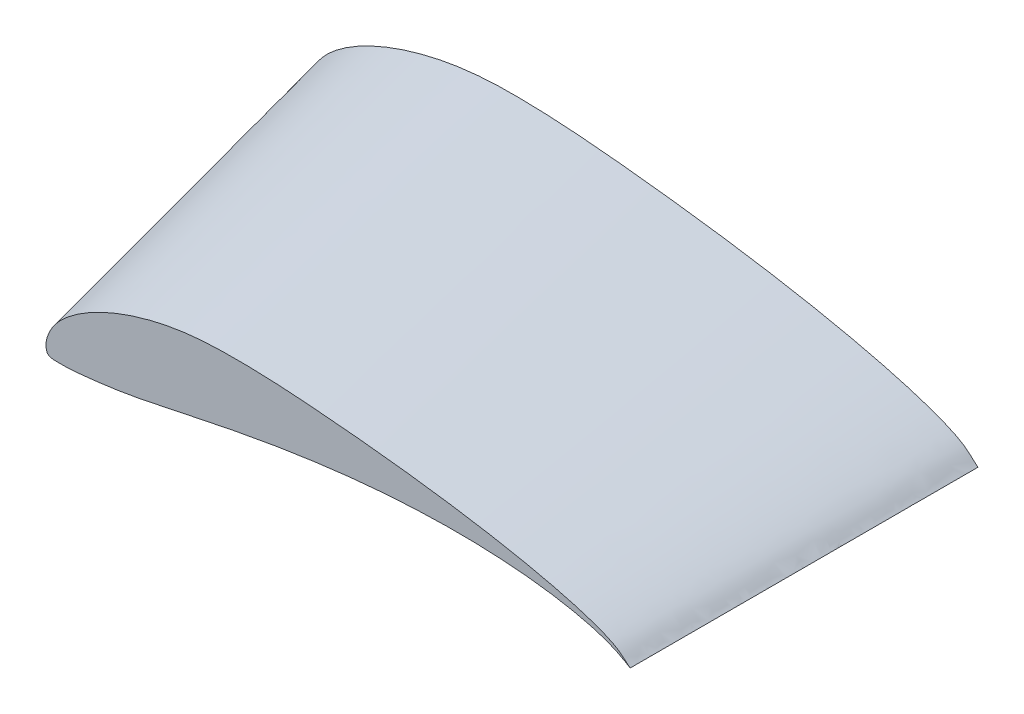
ISO-10303-21;
HEADER;
FILE_DESCRIPTION(('STEP AP214'),'2;1');
FILE_NAME('part.step','',(''),(''),'','','');
FILE_SCHEMA(('AUTOMOTIVE_DESIGN { 1 0 10303 214 1 1 1 1 }'));
ENDSEC;
DATA;
#1=APPLICATION_CONTEXT('core data for automotive mechanical design processes');
#2=APPLICATION_PROTOCOL_DEFINITION('international standard','automotive_design',2000,#1);
#3=PRODUCT_CONTEXT('',#1,'mechanical');
#4=PRODUCT('Part','Part','',(#3));
#5=PRODUCT_RELATED_PRODUCT_CATEGORY('part','',(#4));
#6=PRODUCT_DEFINITION_FORMATION('','',#4);
#7=PRODUCT_DEFINITION_CONTEXT('part definition',#1,'design');
#8=PRODUCT_DEFINITION('design','',#6,#7);
#9=PRODUCT_DEFINITION_SHAPE('','',#8);
#10=(LENGTH_UNIT() NAMED_UNIT(*) SI_UNIT(.MILLI.,.METRE.));
#11=(NAMED_UNIT(*) PLANE_ANGLE_UNIT() SI_UNIT($,.RADIAN.));
#12=(NAMED_UNIT(*) SI_UNIT($,.STERADIAN.) SOLID_ANGLE_UNIT());
#13=UNCERTAINTY_MEASURE_WITH_UNIT(LENGTH_MEASURE(1.E-05),#10,'distance_accuracy_value','');
#14=(GEOMETRIC_REPRESENTATION_CONTEXT(3) GLOBAL_UNCERTAINTY_ASSIGNED_CONTEXT((#13)) GLOBAL_UNIT_ASSIGNED_CONTEXT((#10,
#11,#12)) REPRESENTATION_CONTEXT('',''));
#15=CARTESIAN_POINT('',(0.,0.,0.));
#16=DIRECTION('',(0.,0.,1.));
#17=DIRECTION('',(1.,0.,0.));
#18=AXIS2_PLACEMENT_3D('',#15,#16,#17);
#19=CARTESIAN_POINT('',(147.647882690955,1.94864390222236,153.125));
#20=DIRECTION('',(-4.07845414898287E-13,0.,-1.));
#21=DIRECTION('',(-1.,0.,4.07845414898287E-13));
#22=AXIS2_PLACEMENT_3D('',#19,#20,#21);
#23=PLANE('',#22);
#24=CARTESIAN_POINT('',(18.781431230713,-2.87183284475704,153.125));
#25=CARTESIAN_POINT('',(18.7868267016805,-3.09753114133318,153.125));
#26=CARTESIAN_POINT('',(18.838354982009,-3.58530757523726,153.125));
#27=CARTESIAN_POINT('',(19.0736565177137,-4.35928574512546,153.125));
#28=CARTESIAN_POINT('',(19.9992366287412,-4.7754949083358,153.125));
#29=CARTESIAN_POINT('',(21.2324186739689,-4.8101931222816,153.125));
#30=CARTESIAN_POINT('',(22.9188833774111,-4.83327265438431,153.125));
#31=CARTESIAN_POINT('',(25.0361684704005,-4.69637406887698,153.125));
#32=CARTESIAN_POINT('',(27.5619136664684,-4.47411427744244,153.125));
#33=CARTESIAN_POINT('',(30.4674435583535,-4.14258807372463,153.125));
#34=CARTESIAN_POINT('',(33.7230982742044,-3.70852892050042,153.125));
#35=CARTESIAN_POINT('',(37.3127965409837,-3.16446834446383,153.125));
#36=CARTESIAN_POINT('',(41.2330005290168,-2.42762007153233,153.125));
#37=CARTESIAN_POINT('',(45.5032932916208,-1.51748850673608,153.125));
#38=CARTESIAN_POINT('',(50.1471179146755,-0.527052601916303,153.125));
#39=CARTESIAN_POINT('',(55.1421659431544,0.520677932482574,153.125));
#40=CARTESIAN_POINT('',(60.457774346606,1.58600914832818,153.125));
#41=CARTESIAN_POINT('',(66.0555214097221,2.63241942597996,153.125));
#42=CARTESIAN_POINT('',(71.8924890738908,3.62805899370742,153.125));
#43=CARTESIAN_POINT('',(77.9188989248418,4.53993357052145,153.125));
#44=CARTESIAN_POINT('',(84.080895162353,5.34410340741796,153.125));
#45=CARTESIAN_POINT('',(90.3207809451634,6.00916843683569,153.125));
#46=CARTESIAN_POINT('',(96.5761198752376,6.5199615178078,153.125));
#47=CARTESIAN_POINT('',(102.781794990103,6.8601908667507,153.125));
#48=CARTESIAN_POINT('',(108.870680425767,7.01709385951234,153.125));
#49=CARTESIAN_POINT('',(114.774876994317,6.98743620354725,153.125));
#50=CARTESIAN_POINT('',(120.426737982229,6.77342776151695,153.125));
#51=CARTESIAN_POINT('',(125.758294241592,6.3779362320491,153.125));
#52=CARTESIAN_POINT('',(130.705780525973,5.81916812715865,153.125));
#53=CARTESIAN_POINT('',(135.204553795789,5.11503152664773,153.125));
#54=CARTESIAN_POINT('',(139.201493785666,4.29120376882425,153.125));
#55=CARTESIAN_POINT('',(142.622328409077,3.3912867417037,153.125));
#56=CARTESIAN_POINT('',(145.427129141953,2.41264472366272,153.125));
#57=CARTESIAN_POINT('',(147.432779194414,1.5050119743903,153.125));
#58=CARTESIAN_POINT('',(148.915315006376,0.657796267485315,153.125));
#59=CARTESIAN_POINT('',(149.484894848937,0.329848918970999,153.125));
#60=CARTESIAN_POINT('',(150.120774118163,-0.0821492712393803,153.125));
#61=CARTESIAN_POINT('',(149.562452491907,0.315485584546125,153.125));
#62=CARTESIAN_POINT('',(149.189955288901,0.66559303626175,153.125));
#63=CARTESIAN_POINT('',(148.363873463861,1.39582953362196,153.125));
#64=CARTESIAN_POINT('',(147.3911518501,2.17064435905514,153.125));
#65=CARTESIAN_POINT('',(146.066697801357,2.94435967983548,153.125));
#66=CARTESIAN_POINT('',(144.42445390359,3.68647402523134,153.125));
#67=CARTESIAN_POINT('',(142.444609269654,4.45524848366177,153.125));
#68=CARTESIAN_POINT('',(140.13039770604,5.23945600136892,153.125));
#69=CARTESIAN_POINT('',(137.492658643011,6.03343843046408,153.125));
#70=CARTESIAN_POINT('',(134.545149248549,6.83010572294354,153.125));
#71=CARTESIAN_POINT('',(131.304358025293,7.62577570816304,153.125));
#72=CARTESIAN_POINT('',(127.788247207683,8.41288932338237,153.125));
#73=CARTESIAN_POINT('',(124.017003457346,9.18563559384074,153.125));
#74=CARTESIAN_POINT('',(120.013109553319,9.93916492138265,153.125));
#75=CARTESIAN_POINT('',(115.800997726232,10.6696862524713,153.125));
#76=CARTESIAN_POINT('',(111.405399740823,11.3676280851249,153.125));
#77=CARTESIAN_POINT('',(106.853912700271,12.0324510574789,153.125));
#78=CARTESIAN_POINT('',(102.172883634252,12.6549014464084,153.125));
#79=CARTESIAN_POINT('',(97.3924542111098,13.237038320033,153.125));
#80=CARTESIAN_POINT('',(92.5432835574703,13.7740934071276,153.125));
#81=CARTESIAN_POINT('',(87.6604385913798,14.2647680058691,153.125));
#82=CARTESIAN_POINT('',(82.7827612441942,14.7141129943123,153.125));
#83=CARTESIAN_POINT('',(77.9508330726404,15.1090186091978,153.125));
#84=CARTESIAN_POINT('',(73.2041321936566,15.440999411335,153.125));
#85=CARTESIAN_POINT('',(68.5765017767563,15.6863588623241,153.125));
#86=CARTESIAN_POINT('',(64.094729777541,15.8272473632265,153.125));
#87=CARTESIAN_POINT('',(59.7843037414185,15.8370852208806,153.125));
#88=CARTESIAN_POINT('',(55.666834248942,15.737759423063,153.125));
#89=CARTESIAN_POINT('',(51.7516659978601,15.4519709369028,153.125));
#90=CARTESIAN_POINT('',(48.0376292148477,14.9634579184961,153.125));
#91=CARTESIAN_POINT('',(44.5087574499342,14.3096921515708,153.125));
#92=CARTESIAN_POINT('',(41.1642294776612,13.4890969921482,153.125));
#93=CARTESIAN_POINT('',(38.0066065438596,12.5432485805025,153.125));
#94=CARTESIAN_POINT('',(35.0489948667311,11.4879797512114,153.125));
#95=CARTESIAN_POINT('',(32.3035655981462,10.3467440496925,153.125));
#96=CARTESIAN_POINT('',(29.7873990548422,9.12570672306618,153.125));
#97=CARTESIAN_POINT('',(27.5081362014442,7.8487253447693,153.125));
#98=CARTESIAN_POINT('',(25.4780206160428,6.53002795821361,153.125));
#99=CARTESIAN_POINT('',(23.709584109373,5.18716239441179,153.125));
#100=CARTESIAN_POINT('',(22.2029741802822,3.84779048604413,153.125));
#101=CARTESIAN_POINT('',(20.9807524350248,2.49812969032615,153.125));
#102=CARTESIAN_POINT('',(20.0486232194929,1.14976329507944,153.125));
#103=CARTESIAN_POINT('',(19.3667605872918,-0.157186159532591,153.125));
#104=CARTESIAN_POINT('',(18.9383183013389,-1.39337057118495,153.125));
#105=CARTESIAN_POINT('',(18.7843008179128,-2.30329003106365,153.125));
#106=CARTESIAN_POINT('',(18.7791391904739,-2.77595436060582,153.125));
#107=CARTESIAN_POINT('',(18.781431230713,-2.87183284475704,153.125));
#108=B_SPLINE_CURVE_WITH_KNOTS('',3,(#24,#25,#26,#27,#28,#29,#30,#31,#32,#33,#34,#35,#36,#37,
#38,#39,#40,#41,#42,#43,#44,#45,#46,#47,#48,#49,#50,#51,#52,#53,#54,#55,#56,#57,#58,#59,#60,#61,
#62,#63,#64,#65,#66,#67,#68,#69,#70,#71,#72,#73,#74,#75,#76,#77,#78,#79,#80,#81,#82,#83,#84,#85,
#86,#87,#88,#89,#90,#91,#92,#93,#94,#95,#96,#97,#98,#99,#100,#101,#102,#103,#104,#105,#106,
#107),.UNSPECIFIED.,.T.,.F.,(4,1,1,1,1,1,1,1,1,1,1,1,1,1,1,1,1,1,1,1,1,1,1,1,1,1,1,1,1,1,1,1,1,
1,1,1,1,1,1,1,1,1,1,1,1,1,1,1,1,1,1,1,1,1,1,1,1,1,1,1,1,1,1,1,1,1,1,1,1,1,1,1,1,1,1,1,1,1,1,1,1,
4),(0.,0.00247931067276186,0.0053469266184708,0.00825005258262002,0.0127233551712056,
0.0188737939894134,0.026615654379647,0.0358678444798659,0.0465373668174299,0.0585204810883526,
0.0717041242073355,0.086146960783352,0.102035036646421,0.119343600321535,0.137956123600265,
0.157722256787415,0.178494963994404,0.200089650856322,0.222326688956109,0.244994117495875,
0.267888553676581,0.290789682676674,0.313466597821426,0.335692284872131,0.357238290499507,
0.377878162950786,0.397392011332277,0.415558767573653,0.432186193034042,0.447069210350514,
0.460035821626471,0.470855623071696,0.479151791017696,0.484752565241682,0.487900405678421,
0.48889999999172,0.489879677548854,0.492548862159483,0.496383498511198,0.500995277177313,
0.506425590768598,0.512951779985591,0.520683050544478,0.529577828074982,0.539610300782198,
0.550733229053899,0.562889250476305,0.576018173182401,0.590045048761511,0.604890637103547,
0.620470421632309,0.636688379294681,0.653450916874136,0.670657895142251,0.688211954936065,
0.705995071703984,0.723890228455705,0.741756883113729,0.759440593721291,0.776786779257764,
0.793673437591394,0.810001419205781,0.825706063166531,0.840700032575757,0.854931063383801,
0.868515674911555,0.881552962870906,0.894070358699215,0.906071919041655,0.917503516902904,
0.928318959099979,0.938496586055882,0.94800207909488,0.956807877526366,0.964888300728247,
0.972208968737869,0.978774507808121,0.984703249710927,0.990049411687272,0.99480307324776,
0.998946768528383,1.),.UNSPECIFIED.);
#109=CARTESIAN_POINT('',(18.781431230713,-2.87183284475704,153.125));
#110=VERTEX_POINT('',#109);
#111=EDGE_CURVE('E44',#110,#110,#108,.F.);
#112=ORIENTED_EDGE('',*,*,#111,.F.);
#113=EDGE_LOOP('',(#112));
#114=FACE_BOUND('',#113,.T.);
#115=ADVANCED_FACE('F41',(#114),#23,.F.);
#116=CARTESIAN_POINT('',(147.361087855862,2.28513296734556,75.));
#117=DIRECTION('',(1.49528115290138E-13,0.,-1.));
#118=DIRECTION('',(-1.,0.,-1.49528115290138E-13));
#119=AXIS2_PLACEMENT_3D('',#116,#117,#118);
#120=PLANE('',#119);
#121=CARTESIAN_POINT('',(1.02781101227535E-05,-0.00986449623670708,75.));
#122=CARTESIAN_POINT('',(0.000548111937774906,-0.267878539747917,75.));
#123=CARTESIAN_POINT('',(0.0472626618405319,-0.826489328128653,75.));
#124=CARTESIAN_POINT('',(0.296818428144351,-1.71669168240622,75.));
#125=CARTESIAN_POINT('',(1.34399590583567,-2.2153220143065,75.));
#126=CARTESIAN_POINT('',(2.75214635583259,-2.28571250716803,75.));
#127=CARTESIAN_POINT('',(4.67850051945847,-2.35412859107603,75.));
#128=CARTESIAN_POINT('',(7.10109213474685,-2.25049696083349,75.));
#129=CARTESIAN_POINT('',(9.99251237349676,-2.05951632249734,75.));
#130=CARTESIAN_POINT('',(13.3205931283223,-1.75315802660812,75.));
#131=CARTESIAN_POINT('',(17.0512775954276,-1.33837616882355,75.));
#132=CARTESIAN_POINT('',(21.1663777493917,-0.806236455276061,75.));
#133=CARTESIAN_POINT('',(25.6639152876827,-0.0620603139213689,75.));
#134=CARTESIAN_POINT('',(30.5657792465604,0.871378580307179,75.));
#135=CARTESIAN_POINT('',(35.8964372624993,1.88725938901887,75.));
#136=CARTESIAN_POINT('',(41.6298263636064,2.9598477369283,75.));
#137=CARTESIAN_POINT('',(47.7299218042866,4.04455437653433,75.));
#138=CARTESIAN_POINT('',(54.1519129709237,5.10060814991483,75.));
#139=CARTESIAN_POINT('',(60.8459682699352,6.09268798297526,75.));
#140=CARTESIAN_POINT('',(67.7543890329755,6.9843361398765,75.));
#141=CARTESIAN_POINT('',(74.8150435721905,7.74954211330217,75.));
#142=CARTESIAN_POINT('',(81.9612254877641,8.35386710869624,75.));
#143=CARTESIAN_POINT('',(89.1212177404963,8.78153799605541,75.));
#144=CARTESIAN_POINT('',(96.220212479205,9.01556347534524,75.));
#145=CARTESIAN_POINT('',(103.181194498136,9.04303469629456,75.));
#146=CARTESIAN_POINT('',(109.926502556761,8.86194901902542,75.));
#147=CARTESIAN_POINT('',(116.378899617892,8.47651792016937,75.));
#148=CARTESIAN_POINT('',(122.460796636297,7.89171254868704,75.));
#149=CARTESIAN_POINT('',(128.099790298758,7.12992514558223,75.));
#150=CARTESIAN_POINT('',(133.222466898318,6.21322885215876,75.));
#151=CARTESIAN_POINT('',(137.768772176685,5.17228657159243,75.));
#152=CARTESIAN_POINT('',(141.654931000593,4.05876887414132,75.));
#153=CARTESIAN_POINT('',(144.835255918468,2.87065969325588,75.));
#154=CARTESIAN_POINT('',(147.104253470448,1.78360851317507,75.));
#155=CARTESIAN_POINT('',(148.777054722266,0.778630866538671,75.));
#156=CARTESIAN_POINT('',(149.419672052869,0.38972272401338,75.));
#157=CARTESIAN_POINT('',(150.135946628897,-0.0968735947889004,75.));
#158=CARTESIAN_POINT('',(149.507930169283,0.371377778407457,75.));
#159=CARTESIAN_POINT('',(149.091049020768,0.780692200444353,75.));
#160=CARTESIAN_POINT('',(148.165385918256,1.63564488717687,75.));
#161=CARTESIAN_POINT('',(147.073285762807,2.54518803078999,75.));
#162=CARTESIAN_POINT('',(145.579273929923,3.46224404255344,75.));
#163=CARTESIAN_POINT('',(143.721372273851,4.35111616153235,75.));
#164=CARTESIAN_POINT('',(141.478397693166,5.27886655467895,75.));
#165=CARTESIAN_POINT('',(138.853765182207,6.23258673383335,75.));
#166=CARTESIAN_POINT('',(135.85971864832,7.20554154204954,75.));
#167=CARTESIAN_POINT('',(132.511800063579,8.18928701155355,75.));
#168=CARTESIAN_POINT('',(128.828757145348,9.17920486900046,75.));
#169=CARTESIAN_POINT('',(124.830924819146,10.1662104195705,75.));
#170=CARTESIAN_POINT('',(120.54122319012,11.1431608499966,75.));
#171=CARTESIAN_POINT('',(115.985219841489,12.1039545564816,75.));
#172=CARTESIAN_POINT('',(111.190736161851,13.0436508102587,75.));
#173=CARTESIAN_POINT('',(106.185791668959,13.9506967600958,75.));
#174=CARTESIAN_POINT('',(101.001904956753,14.8237881075425,75.));
#175=CARTESIAN_POINT('',(95.6689490433944,15.6516948201271,75.));
#176=CARTESIAN_POINT('',(90.2214146874853,16.4360180876638,75.));
#177=CARTESIAN_POINT('',(84.6942136733632,17.1705453823488,75.));
#178=CARTESIAN_POINT('',(79.1273805633578,17.8529185629788,75.));
#179=CARTESIAN_POINT('',(73.5654214973004,18.4879403082002,75.));
#180=CARTESIAN_POINT('',(68.054377516833,19.0596198460297,75.));
#181=CARTESIAN_POINT('',(62.6391441800531,19.5572775987895,75.));
#182=CARTESIAN_POINT('',(57.35779940524,19.9529944989166,75.));
#183=CARTESIAN_POINT('',(52.2405056996451,20.2257080008233,75.));
#184=CARTESIAN_POINT('',(47.3157220885386,20.3444131036101,75.));
#185=CARTESIAN_POINT('',(42.6086861718548,20.3335787752035,75.));
#186=CARTESIAN_POINT('',(38.1281478975343,20.1046513112592,75.));
#187=CARTESIAN_POINT('',(33.8723652710563,19.6390793340002,75.));
#188=CARTESIAN_POINT('',(29.8240294835822,18.9800756122592,75.));
#189=CARTESIAN_POINT('',(25.982162907299,18.1258591702176,75.));
#190=CARTESIAN_POINT('',(22.3507285308284,17.1238704341562,75.));
#191=CARTESIAN_POINT('',(18.9450960578767,15.9918730111014,75.));
#192=CARTESIAN_POINT('',(15.7797567934298,14.7563611317165,75.));
#193=CARTESIAN_POINT('',(12.8743801617642,13.4239532815015,75.));
#194=CARTESIAN_POINT('',(10.238291416027,12.0217182709884,75.));
#195=CARTESIAN_POINT('',(7.88583461059793,10.5656076033478,75.));
#196=CARTESIAN_POINT('',(5.83176589681337,9.07535873582966,75.));
#197=CARTESIAN_POINT('',(4.0769434500407,7.5825739909971,75.));
#198=CARTESIAN_POINT('',(2.64680221041335,6.07094314969679,75.));
#199=CARTESIAN_POINT('',(1.54814866536494,4.55355888811498,75.));
#200=CARTESIAN_POINT('',(0.736478585984626,3.07725753828289,75.));
#201=CARTESIAN_POINT('',(0.216127101284425,1.67549317939585,75.));
#202=CARTESIAN_POINT('',(0.0174635357486838,0.639672550831817,75.));
#203=CARTESIAN_POINT('',(-0.000218198103046812,0.0997419817777905,75.));
#204=CARTESIAN_POINT('',(1.02781101227535E-05,-0.00986449623670708,75.));
#205=B_SPLINE_CURVE_WITH_KNOTS('',3,(#121,#122,#123,#124,#125,#126,#127,#128,#129,#130,#131,
#132,#133,#134,#135,#136,#137,#138,#139,#140,#141,#142,#143,#144,#145,#146,#147,#148,#149,#150,
#151,#152,#153,#154,#155,#156,#157,#158,#159,#160,#161,#162,#163,#164,#165,#166,#167,#168,#169,
#170,#171,#172,#173,#174,#175,#176,#177,#178,#179,#180,#181,#182,#183,#184,#185,#186,#187,#188,
#189,#190,#191,#192,#193,#194,#195,#196,#197,#198,#199,#200,#201,#202,#203,#204),.UNSPECIFIED.,
.T.,.F.,(4,1,1,1,1,1,1,1,1,1,1,1,1,1,1,1,1,1,1,1,1,1,1,1,1,1,1,1,1,1,1,1,1,1,1,1,1,1,1,1,1,1,1,
1,1,1,1,1,1,1,1,1,1,1,1,1,1,1,1,1,1,1,1,1,1,1,1,1,1,1,1,1,1,1,1,1,1,1,1,1,1,4),(0.,
0.00247931067276186,0.0053469266184708,0.00825005258262002,0.0127233551712056,
0.0188737939894134,0.026615654379647,0.0358678444798659,0.0465373668174299,0.0585204810883526,
0.0717041242073355,0.086146960783352,0.102035036646421,0.119343600321535,0.137956123600265,
0.157722256787415,0.178494963994404,0.200089650856322,0.222326688956109,0.244994117495875,
0.267888553676581,0.290789682676674,0.313466597821426,0.335692284872131,0.357238290499507,
0.377878162950786,0.397392011332277,0.415558767573653,0.432186193034042,0.447069210350514,
0.460035821626471,0.470855623071696,0.479151791017696,0.484752565241682,0.487900405678421,
0.48889999999172,0.489879677548854,0.492548862159483,0.496383498511198,0.500995277177313,
0.506425590768598,0.512951779985591,0.520683050544478,0.529577828074982,0.539610300782198,
0.550733229053899,0.562889250476305,0.576018173182401,0.590045048761511,0.604890637103547,
0.620470421632309,0.636688379294681,0.653450916874136,0.670657895142251,0.688211954936065,
0.705995071703984,0.723890228455705,0.741756883113729,0.759440593721291,0.776786779257764,
0.793673437591394,0.810001419205781,0.825706063166531,0.840700032575757,0.854931063383801,
0.868515674911555,0.881552962870906,0.894070358699215,0.906071919041655,0.917503516902904,
0.928318959099979,0.938496586055882,0.94800207909488,0.956807877526366,0.964888300728247,
0.972208968737869,0.978774507808121,0.984703249710927,0.990049411687272,0.99480307324776,
0.998946768528383,1.),.UNSPECIFIED.);
#206=CARTESIAN_POINT('',(1.02781101227535E-05,-0.00986449623670708,75.));
#207=VERTEX_POINT('',#206);
#208=EDGE_CURVE('E10',#207,#207,#205,.T.);
#209=ORIENTED_EDGE('',*,*,#208,.F.);
#210=EDGE_LOOP('',(#209));
#211=FACE_BOUND('',#210,.T.);
#212=ADVANCED_FACE('F71',(#211),#120,.T.);
#213=CARTESIAN_POINT('',(1.02781101227535E-05,-0.00986449623670708,75.));
#214=CARTESIAN_POINT('',(18.781431230713,-2.87183284475704,153.125));
#215=CARTESIAN_POINT('',(0.000548111937774906,-0.267878539747917,75.));
#216=CARTESIAN_POINT('',(18.7868267016805,-3.09753114133318,153.125));
#217=CARTESIAN_POINT('',(0.0472626618405319,-0.826489328128653,75.));
#218=CARTESIAN_POINT('',(18.838354982009,-3.58530757523726,153.125));
#219=CARTESIAN_POINT('',(0.296818428144351,-1.71669168240622,75.));
#220=CARTESIAN_POINT('',(19.0736565177137,-4.35928574512546,153.125));
#221=CARTESIAN_POINT('',(1.34399590583567,-2.2153220143065,75.));
#222=CARTESIAN_POINT('',(19.9992366287412,-4.7754949083358,153.125));
#223=CARTESIAN_POINT('',(2.75214635583259,-2.28571250716803,75.));
#224=CARTESIAN_POINT('',(21.2324186739689,-4.8101931222816,153.125));
#225=CARTESIAN_POINT('',(4.67850051945847,-2.35412859107603,75.));
#226=CARTESIAN_POINT('',(22.9188833774111,-4.83327265438431,153.125));
#227=CARTESIAN_POINT('',(7.10109213474685,-2.25049696083349,75.));
#228=CARTESIAN_POINT('',(25.0361684704005,-4.69637406887698,153.125));
#229=CARTESIAN_POINT('',(9.99251237349676,-2.05951632249734,75.));
#230=CARTESIAN_POINT('',(27.5619136664684,-4.47411427744244,153.125));
#231=CARTESIAN_POINT('',(13.3205931283223,-1.75315802660812,75.));
#232=CARTESIAN_POINT('',(30.4674435583535,-4.14258807372463,153.125));
#233=CARTESIAN_POINT('',(17.0512775954276,-1.33837616882355,75.));
#234=CARTESIAN_POINT('',(33.7230982742044,-3.70852892050042,153.125));
#235=CARTESIAN_POINT('',(21.1663777493917,-0.806236455276061,75.));
#236=CARTESIAN_POINT('',(37.3127965409837,-3.16446834446383,153.125));
#237=CARTESIAN_POINT('',(25.6639152876827,-0.0620603139213689,75.));
#238=CARTESIAN_POINT('',(41.2330005290168,-2.42762007153233,153.125));
#239=CARTESIAN_POINT('',(30.5657792465604,0.871378580307179,75.));
#240=CARTESIAN_POINT('',(45.5032932916208,-1.51748850673608,153.125));
#241=CARTESIAN_POINT('',(35.8964372624993,1.88725938901887,75.));
#242=CARTESIAN_POINT('',(50.1471179146755,-0.527052601916303,153.125));
#243=CARTESIAN_POINT('',(41.6298263636064,2.9598477369283,75.));
#244=CARTESIAN_POINT('',(55.1421659431544,0.520677932482574,153.125));
#245=CARTESIAN_POINT('',(47.7299218042866,4.04455437653433,75.));
#246=CARTESIAN_POINT('',(60.457774346606,1.58600914832818,153.125));
#247=CARTESIAN_POINT('',(54.1519129709237,5.10060814991483,75.));
#248=CARTESIAN_POINT('',(66.0555214097221,2.63241942597996,153.125));
#249=CARTESIAN_POINT('',(60.8459682699352,6.09268798297526,75.));
#250=CARTESIAN_POINT('',(71.8924890738908,3.62805899370742,153.125));
#251=CARTESIAN_POINT('',(67.7543890329755,6.9843361398765,75.));
#252=CARTESIAN_POINT('',(77.9188989248418,4.53993357052145,153.125));
#253=CARTESIAN_POINT('',(74.8150435721905,7.74954211330217,75.));
#254=CARTESIAN_POINT('',(84.080895162353,5.34410340741796,153.125));
#255=CARTESIAN_POINT('',(81.9612254877641,8.35386710869624,75.));
#256=CARTESIAN_POINT('',(90.3207809451634,6.00916843683569,153.125));
#257=CARTESIAN_POINT('',(89.1212177404963,8.78153799605541,75.));
#258=CARTESIAN_POINT('',(96.5761198752376,6.5199615178078,153.125));
#259=CARTESIAN_POINT('',(96.220212479205,9.01556347534524,75.));
#260=CARTESIAN_POINT('',(102.781794990103,6.8601908667507,153.125));
#261=CARTESIAN_POINT('',(103.181194498136,9.04303469629456,75.));
#262=CARTESIAN_POINT('',(108.870680425767,7.01709385951234,153.125));
#263=CARTESIAN_POINT('',(109.926502556761,8.86194901902542,75.));
#264=CARTESIAN_POINT('',(114.774876994317,6.98743620354725,153.125));
#265=CARTESIAN_POINT('',(116.378899617892,8.47651792016937,75.));
#266=CARTESIAN_POINT('',(120.426737982229,6.77342776151695,153.125));
#267=CARTESIAN_POINT('',(122.460796636297,7.89171254868704,75.));
#268=CARTESIAN_POINT('',(125.758294241592,6.3779362320491,153.125));
#269=CARTESIAN_POINT('',(128.099790298758,7.12992514558223,75.));
#270=CARTESIAN_POINT('',(130.705780525973,5.81916812715865,153.125));
#271=CARTESIAN_POINT('',(133.222466898318,6.21322885215876,75.));
#272=CARTESIAN_POINT('',(135.204553795789,5.11503152664773,153.125));
#273=CARTESIAN_POINT('',(137.768772176685,5.17228657159243,75.));
#274=CARTESIAN_POINT('',(139.201493785666,4.29120376882425,153.125));
#275=CARTESIAN_POINT('',(141.654931000593,4.05876887414132,75.));
#276=CARTESIAN_POINT('',(142.622328409077,3.3912867417037,153.125));
#277=CARTESIAN_POINT('',(144.835255918468,2.87065969325588,75.));
#278=CARTESIAN_POINT('',(145.427129141953,2.41264472366272,153.125));
#279=CARTESIAN_POINT('',(147.104253470448,1.78360851317507,75.));
#280=CARTESIAN_POINT('',(147.432779194414,1.5050119743903,153.125));
#281=CARTESIAN_POINT('',(148.777054722266,0.778630866538671,75.));
#282=CARTESIAN_POINT('',(148.915315006376,0.657796267485315,153.125));
#283=CARTESIAN_POINT('',(149.419672052869,0.38972272401338,75.));
#284=CARTESIAN_POINT('',(149.484894848937,0.329848918970999,153.125));
#285=CARTESIAN_POINT('',(150.135946628897,-0.0968735947889004,75.));
#286=CARTESIAN_POINT('',(150.120774118163,-0.0821492712393803,153.125));
#287=CARTESIAN_POINT('',(149.507930169283,0.371377778407457,75.));
#288=CARTESIAN_POINT('',(149.562452491907,0.315485584546125,153.125));
#289=CARTESIAN_POINT('',(149.091049020768,0.780692200444353,75.));
#290=CARTESIAN_POINT('',(149.189955288901,0.66559303626175,153.125));
#291=CARTESIAN_POINT('',(148.165385918256,1.63564488717687,75.));
#292=CARTESIAN_POINT('',(148.363873463861,1.39582953362196,153.125));
#293=CARTESIAN_POINT('',(147.073285762807,2.54518803078999,75.));
#294=CARTESIAN_POINT('',(147.3911518501,2.17064435905514,153.125));
#295=CARTESIAN_POINT('',(145.579273929923,3.46224404255344,75.));
#296=CARTESIAN_POINT('',(146.066697801357,2.94435967983548,153.125));
#297=CARTESIAN_POINT('',(143.721372273851,4.35111616153235,75.));
#298=CARTESIAN_POINT('',(144.42445390359,3.68647402523134,153.125));
#299=CARTESIAN_POINT('',(141.478397693166,5.27886655467895,75.));
#300=CARTESIAN_POINT('',(142.444609269654,4.45524848366177,153.125));
#301=CARTESIAN_POINT('',(138.853765182207,6.23258673383335,75.));
#302=CARTESIAN_POINT('',(140.13039770604,5.23945600136892,153.125));
#303=CARTESIAN_POINT('',(135.85971864832,7.20554154204954,75.));
#304=CARTESIAN_POINT('',(137.492658643011,6.03343843046408,153.125));
#305=CARTESIAN_POINT('',(132.511800063579,8.18928701155355,75.));
#306=CARTESIAN_POINT('',(134.545149248549,6.83010572294354,153.125));
#307=CARTESIAN_POINT('',(128.828757145348,9.17920486900046,75.));
#308=CARTESIAN_POINT('',(131.304358025293,7.62577570816304,153.125));
#309=CARTESIAN_POINT('',(124.830924819146,10.1662104195705,75.));
#310=CARTESIAN_POINT('',(127.788247207683,8.41288932338237,153.125));
#311=CARTESIAN_POINT('',(120.54122319012,11.1431608499966,75.));
#312=CARTESIAN_POINT('',(124.017003457346,9.18563559384074,153.125));
#313=CARTESIAN_POINT('',(115.985219841489,12.1039545564816,75.));
#314=CARTESIAN_POINT('',(120.013109553319,9.93916492138265,153.125));
#315=CARTESIAN_POINT('',(111.190736161851,13.0436508102587,75.));
#316=CARTESIAN_POINT('',(115.800997726232,10.6696862524713,153.125));
#317=CARTESIAN_POINT('',(106.185791668959,13.9506967600958,75.));
#318=CARTESIAN_POINT('',(111.405399740823,11.3676280851249,153.125));
#319=CARTESIAN_POINT('',(101.001904956753,14.8237881075425,75.));
#320=CARTESIAN_POINT('',(106.853912700271,12.0324510574789,153.125));
#321=CARTESIAN_POINT('',(95.6689490433944,15.6516948201271,75.));
#322=CARTESIAN_POINT('',(102.172883634252,12.6549014464084,153.125));
#323=CARTESIAN_POINT('',(90.2214146874853,16.4360180876638,75.));
#324=CARTESIAN_POINT('',(97.3924542111098,13.237038320033,153.125));
#325=CARTESIAN_POINT('',(84.6942136733632,17.1705453823488,75.));
#326=CARTESIAN_POINT('',(92.5432835574703,13.7740934071276,153.125));
#327=CARTESIAN_POINT('',(79.1273805633578,17.8529185629788,75.));
#328=CARTESIAN_POINT('',(87.6604385913798,14.2647680058691,153.125));
#329=CARTESIAN_POINT('',(73.5654214973004,18.4879403082002,75.));
#330=CARTESIAN_POINT('',(82.7827612441942,14.7141129943123,153.125));
#331=CARTESIAN_POINT('',(68.054377516833,19.0596198460297,75.));
#332=CARTESIAN_POINT('',(77.9508330726404,15.1090186091978,153.125));
#333=CARTESIAN_POINT('',(62.6391441800531,19.5572775987895,75.));
#334=CARTESIAN_POINT('',(73.2041321936566,15.440999411335,153.125));
#335=CARTESIAN_POINT('',(57.35779940524,19.9529944989166,75.));
#336=CARTESIAN_POINT('',(68.5765017767563,15.6863588623241,153.125));
#337=CARTESIAN_POINT('',(52.2405056996451,20.2257080008233,75.));
#338=CARTESIAN_POINT('',(64.094729777541,15.8272473632265,153.125));
#339=CARTESIAN_POINT('',(47.3157220885386,20.3444131036101,75.));
#340=CARTESIAN_POINT('',(59.7843037414185,15.8370852208806,153.125));
#341=CARTESIAN_POINT('',(42.6086861718548,20.3335787752035,75.));
#342=CARTESIAN_POINT('',(55.666834248942,15.737759423063,153.125));
#343=CARTESIAN_POINT('',(38.1281478975343,20.1046513112592,75.));
#344=CARTESIAN_POINT('',(51.7516659978601,15.4519709369028,153.125));
#345=CARTESIAN_POINT('',(33.8723652710563,19.6390793340002,75.));
#346=CARTESIAN_POINT('',(48.0376292148477,14.9634579184961,153.125));
#347=CARTESIAN_POINT('',(29.8240294835822,18.9800756122592,75.));
#348=CARTESIAN_POINT('',(44.5087574499342,14.3096921515708,153.125));
#349=CARTESIAN_POINT('',(25.982162907299,18.1258591702176,75.));
#350=CARTESIAN_POINT('',(41.1642294776612,13.4890969921482,153.125));
#351=CARTESIAN_POINT('',(22.3507285308284,17.1238704341562,75.));
#352=CARTESIAN_POINT('',(38.0066065438596,12.5432485805025,153.125));
#353=CARTESIAN_POINT('',(18.9450960578767,15.9918730111014,75.));
#354=CARTESIAN_POINT('',(35.0489948667311,11.4879797512114,153.125));
#355=CARTESIAN_POINT('',(15.7797567934298,14.7563611317165,75.));
#356=CARTESIAN_POINT('',(32.3035655981462,10.3467440496925,153.125));
#357=CARTESIAN_POINT('',(12.8743801617642,13.4239532815015,75.));
#358=CARTESIAN_POINT('',(29.7873990548422,9.12570672306618,153.125));
#359=CARTESIAN_POINT('',(10.238291416027,12.0217182709884,75.));
#360=CARTESIAN_POINT('',(27.5081362014442,7.8487253447693,153.125));
#361=CARTESIAN_POINT('',(7.88583461059793,10.5656076033478,75.));
#362=CARTESIAN_POINT('',(25.4780206160428,6.53002795821361,153.125));
#363=CARTESIAN_POINT('',(5.83176589681337,9.07535873582966,75.));
#364=CARTESIAN_POINT('',(23.709584109373,5.18716239441179,153.125));
#365=CARTESIAN_POINT('',(4.0769434500407,7.5825739909971,75.));
#366=CARTESIAN_POINT('',(22.2029741802822,3.84779048604413,153.125));
#367=CARTESIAN_POINT('',(2.64680221041335,6.07094314969679,75.));
#368=CARTESIAN_POINT('',(20.9807524350248,2.49812969032615,153.125));
#369=CARTESIAN_POINT('',(1.54814866536494,4.55355888811498,75.));
#370=CARTESIAN_POINT('',(20.0486232194929,1.14976329507944,153.125));
#371=CARTESIAN_POINT('',(0.736478585984626,3.07725753828289,75.));
#372=CARTESIAN_POINT('',(19.3667605872918,-0.157186159532591,153.125));
#373=CARTESIAN_POINT('',(0.216127101284425,1.67549317939585,75.));
#374=CARTESIAN_POINT('',(18.9383183013389,-1.39337057118495,153.125));
#375=CARTESIAN_POINT('',(0.0174635357486838,0.639672550831817,75.));
#376=CARTESIAN_POINT('',(18.7843008179128,-2.30329003106365,153.125));
#377=CARTESIAN_POINT('',(-0.000218198103046812,0.0997419817777905,75.));
#378=CARTESIAN_POINT('',(18.7791391904739,-2.77595436060582,153.125));
#379=CARTESIAN_POINT('',(1.02781101227535E-05,-0.00986449623670708,75.));
#380=CARTESIAN_POINT('',(18.781431230713,-2.87183284475704,153.125));
#381=B_SPLINE_SURFACE_WITH_KNOTS('',3,1,((#213,#214),(#215,#216),(#217,#218),(#219,#220),(#221,
#222),(#223,#224),(#225,#226),(#227,#228),(#229,#230),(#231,#232),(#233,#234),(#235,#236),(#237,
#238),(#239,#240),(#241,#242),(#243,#244),(#245,#246),(#247,#248),(#249,#250),(#251,#252),(#253,
#254),(#255,#256),(#257,#258),(#259,#260),(#261,#262),(#263,#264),(#265,#266),(#267,#268),(#269,
#270),(#271,#272),(#273,#274),(#275,#276),(#277,#278),(#279,#280),(#281,#282),(#283,#284),(#285,
#286),(#287,#288),(#289,#290),(#291,#292),(#293,#294),(#295,#296),(#297,#298),(#299,#300),(#301,
#302),(#303,#304),(#305,#306),(#307,#308),(#309,#310),(#311,#312),(#313,#314),(#315,#316),(#317,
#318),(#319,#320),(#321,#322),(#323,#324),(#325,#326),(#327,#328),(#329,#330),(#331,#332),(#333,
#334),(#335,#336),(#337,#338),(#339,#340),(#341,#342),(#343,#344),(#345,#346),(#347,#348),(#349,
#350),(#351,#352),(#353,#354),(#355,#356),(#357,#358),(#359,#360),(#361,#362),(#363,#364),(#365,
#366),(#367,#368),(#369,#370),(#371,#372),(#373,#374),(#375,#376),(#377,#378),(#379,#380)),
.UNSPECIFIED.,.T.,.F.,.F.,(4,1,1,1,1,1,1,1,1,1,1,1,1,1,1,1,1,1,1,1,1,1,1,1,1,1,1,1,1,1,1,1,1,1,
1,1,1,1,1,1,1,1,1,1,1,1,1,1,1,1,1,1,1,1,1,1,1,1,1,1,1,1,1,1,1,1,1,1,1,1,1,1,1,1,1,1,1,1,1,1,1,
4),(2,2),(0.,0.00247931067276186,0.0053469266184708,0.00825005258262002,0.0127233551712056,
0.0188737939894134,0.026615654379647,0.0358678444798659,0.0465373668174299,0.0585204810883526,
0.0717041242073355,0.086146960783352,0.102035036646421,0.119343600321535,0.137956123600265,
0.157722256787415,0.178494963994404,0.200089650856322,0.222326688956109,0.244994117495875,
0.267888553676581,0.290789682676674,0.313466597821426,0.335692284872131,0.357238290499507,
0.377878162950786,0.397392011332277,0.415558767573653,0.432186193034042,0.447069210350514,
0.460035821626471,0.470855623071696,0.479151791017696,0.484752565241682,0.487900405678421,
0.48889999999172,0.489879677548854,0.492548862159483,0.496383498511198,0.500995277177313,
0.506425590768598,0.512951779985591,0.520683050544478,0.529577828074982,0.539610300782198,
0.550733229053899,0.562889250476305,0.576018173182401,0.590045048761511,0.604890637103547,
0.620470421632309,0.636688379294681,0.653450916874136,0.670657895142251,0.688211954936065,
0.705995071703984,0.723890228455705,0.741756883113729,0.759440593721291,0.776786779257764,
0.793673437591394,0.810001419205781,0.825706063166531,0.840700032575757,0.854931063383801,
0.868515674911555,0.881552962870906,0.894070358699215,0.906071919041655,0.917503516902904,
0.928318959099979,0.938496586055882,0.94800207909488,0.956807877526366,0.964888300728247,
0.972208968737869,0.978774507808121,0.984703249710927,0.990049411687272,0.99480307324776,
0.998946768528383,1.),(0.,1.),.UNSPECIFIED.);
#382=ORIENTED_EDGE('',*,*,#208,.T.);
#383=EDGE_LOOP('',(#382));
#384=FACE_BOUND('',#383,.T.);
#385=ORIENTED_EDGE('',*,*,#111,.T.);
#386=EDGE_LOOP('',(#385));
#387=FACE_BOUND('',#386,.T.);
#388=ADVANCED_FACE('F68',(#384,#387),#381,.T.);
#389=CLOSED_SHELL('',(#115,#212,#388));
#390=MANIFOLD_SOLID_BREP('B2',#389);
#391=ADVANCED_BREP_SHAPE_REPRESENTATION('',(#18,#390),#14);
#392=SHAPE_DEFINITION_REPRESENTATION(#9,#391);
ENDSEC;
END-ISO-10303-21;
